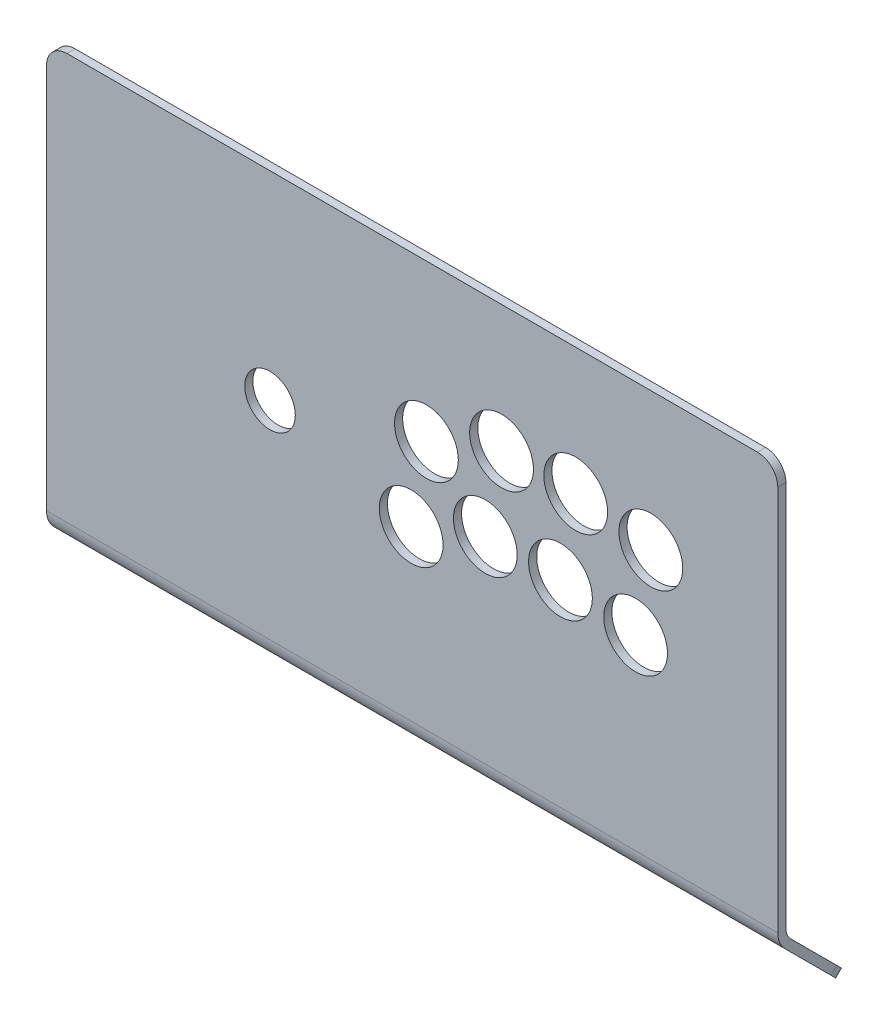
ISO-10303-21;
HEADER;
FILE_DESCRIPTION(('STEP AP214'),'2;1');
FILE_NAME('part.step','',(''),(''),'','','');
FILE_SCHEMA(('AUTOMOTIVE_DESIGN { 1 0 10303 214 1 1 1 1 }'));
ENDSEC;
DATA;
#1=APPLICATION_CONTEXT('core data for automotive mechanical design processes');
#2=APPLICATION_PROTOCOL_DEFINITION('international standard','automotive_design',2000,#1);
#3=PRODUCT_CONTEXT('',#1,'mechanical');
#4=PRODUCT('Part','Part','',(#3));
#5=PRODUCT_RELATED_PRODUCT_CATEGORY('part','',(#4));
#6=PRODUCT_DEFINITION_FORMATION('','',#4);
#7=PRODUCT_DEFINITION_CONTEXT('part definition',#1,'design');
#8=PRODUCT_DEFINITION('design','',#6,#7);
#9=PRODUCT_DEFINITION_SHAPE('','',#8);
#10=(LENGTH_UNIT() NAMED_UNIT(*) SI_UNIT(.MILLI.,.METRE.));
#11=(NAMED_UNIT(*) PLANE_ANGLE_UNIT() SI_UNIT($,.RADIAN.));
#12=(NAMED_UNIT(*) SI_UNIT($,.STERADIAN.) SOLID_ANGLE_UNIT());
#13=UNCERTAINTY_MEASURE_WITH_UNIT(LENGTH_MEASURE(1.E-05),#10,'distance_accuracy_value','');
#14=(GEOMETRIC_REPRESENTATION_CONTEXT(3) GLOBAL_UNCERTAINTY_ASSIGNED_CONTEXT((#13)) GLOBAL_UNIT_ASSIGNED_CONTEXT((#10,
#11,#12)) REPRESENTATION_CONTEXT('',''));
#15=CARTESIAN_POINT('',(0.,0.,0.));
#16=DIRECTION('',(0.,0.,1.));
#17=DIRECTION('',(1.,0.,0.));
#18=AXIS2_PLACEMENT_3D('',#15,#16,#17);
#19=CARTESIAN_POINT('',(180.,0.,2.));
#20=DIRECTION('',(0.,-1.,0.));
#21=DIRECTION('',(0.,0.,-1.));
#22=AXIS2_PLACEMENT_3D('',#19,#20,#21);
#23=PLANE('',#22);
#24=DIRECTION('',(-1.,0.,0.));
#25=VECTOR('',#24,1.);
#26=CARTESIAN_POINT('',(180.,0.,2.));
#27=LINE('',#26,#25);
#28=CARTESIAN_POINT('',(170.,0.,2.));
#29=VERTEX_POINT('',#28);
#30=CARTESIAN_POINT('',(-170.,0.,2.));
#31=VERTEX_POINT('',#30);
#32=EDGE_CURVE('E141',#29,#31,#27,.T.);
#33=ORIENTED_EDGE('',*,*,#32,.F.);
#34=DIRECTION('',(0.,0.,1.));
#35=VECTOR('',#34,1.);
#36=CARTESIAN_POINT('',(170.,0.,-2.));
#37=LINE('',#36,#35);
#38=CARTESIAN_POINT('',(170.,0.,-2.));
#39=VERTEX_POINT('',#38);
#40=EDGE_CURVE('E225',#29,#39,#37,.F.);
#41=ORIENTED_EDGE('',*,*,#40,.T.);
#42=DIRECTION('',(-1.,0.,0.));
#43=VECTOR('',#42,1.);
#44=CARTESIAN_POINT('',(180.,0.,-2.));
#45=LINE('',#44,#43);
#46=CARTESIAN_POINT('',(-170.,0.,-2.));
#47=VERTEX_POINT('',#46);
#48=EDGE_CURVE('E158',#39,#47,#45,.T.);
#49=ORIENTED_EDGE('',*,*,#48,.T.);
#50=DIRECTION('',(0.,0.,1.));
#51=VECTOR('',#50,1.);
#52=CARTESIAN_POINT('',(-170.,0.,2.));
#53=LINE('',#52,#51);
#54=EDGE_CURVE('E222',#47,#31,#53,.T.);
#55=ORIENTED_EDGE('',*,*,#54,.T.);
#56=EDGE_LOOP('',(#33,#41,#49,#55));
#57=FACE_BOUND('',#56,.T.);
#58=ADVANCED_FACE('F32',(#57),#23,.F.);
#59=CARTESIAN_POINT('',(180.,0.,2.));
#60=DIRECTION('',(0.,0.,-1.));
#61=DIRECTION('',(-1.,0.,0.));
#62=AXIS2_PLACEMENT_3D('',#59,#60,#61);
#63=PLANE('',#62);
#64=CARTESIAN_POINT('',(-70.,-98.0000000000002,2.));
#65=DIRECTION('',(0.,0.,1.));
#66=DIRECTION('',(1.,0.,0.));
#67=AXIS2_PLACEMENT_3D('',#64,#65,#66);
#68=CIRCLE('',#67,12.4505949480337);
#69=CARTESIAN_POINT('',(-57.5494050519663,-98.0000000000002,2.));
#70=VERTEX_POINT('',#69);
#71=EDGE_CURVE('E192',#70,#70,#68,.T.);
#72=ORIENTED_EDGE('',*,*,#71,.F.);
#73=EDGE_LOOP('',(#72));
#74=FACE_BOUND('',#73,.T.);
#75=CARTESIAN_POINT('',(110.,-108.,2.));
#76=DIRECTION('',(0.,0.,1.));
#77=DIRECTION('',(1.,0.,0.));
#78=AXIS2_PLACEMENT_3D('',#75,#76,#77);
#79=CIRCLE('',#78,15.7);
#80=CARTESIAN_POINT('',(125.7,-108.,2.));
#81=VERTEX_POINT('',#80);
#82=EDGE_CURVE('E476',#81,#81,#79,.T.);
#83=ORIENTED_EDGE('',*,*,#82,.F.);
#84=EDGE_LOOP('',(#83));
#85=FACE_BOUND('',#84,.T.);
#86=CARTESIAN_POINT('',(117.5,-68.,2.));
#87=DIRECTION('',(0.,0.,1.));
#88=DIRECTION('',(1.,0.,0.));
#89=AXIS2_PLACEMENT_3D('',#86,#87,#88);
#90=CIRCLE('',#89,15.7);
#91=CARTESIAN_POINT('',(133.2,-68.,2.));
#92=VERTEX_POINT('',#91);
#93=EDGE_CURVE('E482',#92,#92,#90,.T.);
#94=ORIENTED_EDGE('',*,*,#93,.F.);
#95=EDGE_LOOP('',(#94));
#96=FACE_BOUND('',#95,.T.);
#97=CARTESIAN_POINT('',(80.4999999999999,-62.5,2.));
#98=DIRECTION('',(0.,0.,1.));
#99=DIRECTION('',(1.,0.,0.));
#100=AXIS2_PLACEMENT_3D('',#97,#98,#99);
#101=CIRCLE('',#100,15.7);
#102=CARTESIAN_POINT('',(96.1999999999999,-62.5,2.));
#103=VERTEX_POINT('',#102);
#104=EDGE_CURVE('E504',#103,#103,#101,.T.);
#105=ORIENTED_EDGE('',*,*,#104,.F.);
#106=EDGE_LOOP('',(#105));
#107=FACE_BOUND('',#106,.T.);
#108=CARTESIAN_POINT('',(43.9999999999999,-62.5,2.));
#109=DIRECTION('',(0.,0.,1.));
#110=DIRECTION('',(1.,0.,0.));
#111=AXIS2_PLACEMENT_3D('',#108,#109,#110);
#112=CIRCLE('',#111,15.7);
#113=CARTESIAN_POINT('',(59.6999999999999,-62.5,2.));
#114=VERTEX_POINT('',#113);
#115=EDGE_CURVE('E507',#114,#114,#112,.T.);
#116=ORIENTED_EDGE('',*,*,#115,.F.);
#117=EDGE_LOOP('',(#116));
#118=FACE_BOUND('',#117,.T.);
#119=CARTESIAN_POINT('',(6.9999999999999,-77.,2.));
#120=DIRECTION('',(0.,0.,1.));
#121=DIRECTION('',(1.,0.,0.));
#122=AXIS2_PLACEMENT_3D('',#119,#120,#121);
#123=CIRCLE('',#122,15.7);
#124=CARTESIAN_POINT('',(22.6999999999999,-77.,2.));
#125=VERTEX_POINT('',#124);
#126=EDGE_CURVE('E486',#125,#125,#123,.T.);
#127=ORIENTED_EDGE('',*,*,#126,.F.);
#128=EDGE_LOOP('',(#127));
#129=FACE_BOUND('',#128,.T.);
#130=CARTESIAN_POINT('',(-0.500000000000084,-117.,2.));
#131=DIRECTION('',(0.,0.,1.));
#132=DIRECTION('',(1.,0.,0.));
#133=AXIS2_PLACEMENT_3D('',#130,#131,#132);
#134=CIRCLE('',#133,15.7);
#135=CARTESIAN_POINT('',(15.1999999999999,-117.,2.));
#136=VERTEX_POINT('',#135);
#137=EDGE_CURVE('E479',#136,#136,#134,.T.);
#138=ORIENTED_EDGE('',*,*,#137,.F.);
#139=EDGE_LOOP('',(#138));
#140=FACE_BOUND('',#139,.T.);
#141=CARTESIAN_POINT('',(35.9999999999999,-103.,2.));
#142=DIRECTION('',(0.,0.,1.));
#143=DIRECTION('',(1.,0.,0.));
#144=AXIS2_PLACEMENT_3D('',#141,#142,#143);
#145=CIRCLE('',#144,15.7);
#146=CARTESIAN_POINT('',(51.6999999999999,-103.,2.));
#147=VERTEX_POINT('',#146);
#148=EDGE_CURVE('E475',#147,#147,#145,.T.);
#149=ORIENTED_EDGE('',*,*,#148,.F.);
#150=EDGE_LOOP('',(#149));
#151=FACE_BOUND('',#150,.T.);
#152=CARTESIAN_POINT('',(72.9999999999999,-103.,2.));
#153=DIRECTION('',(0.,0.,1.));
#154=DIRECTION('',(1.,0.,0.));
#155=AXIS2_PLACEMENT_3D('',#152,#153,#154);
#156=CIRCLE('',#155,15.7);
#157=CARTESIAN_POINT('',(88.6999999999999,-103.,2.));
#158=VERTEX_POINT('',#157);
#159=EDGE_CURVE('E471',#158,#158,#156,.T.);
#160=ORIENTED_EDGE('',*,*,#159,.F.);
#161=EDGE_LOOP('',(#160));
#162=FACE_BOUND('',#161,.T.);
#163=DIRECTION('',(0.,-1.,0.));
#164=VECTOR('',#163,1.);
#165=CARTESIAN_POINT('',(180.,0.,2.));
#166=LINE('',#165,#164);
#167=CARTESIAN_POINT('',(180.,-10.,2.));
#168=VERTEX_POINT('',#167);
#169=CARTESIAN_POINT('',(180.,-200.,2.));
#170=VERTEX_POINT('',#169);
#171=EDGE_CURVE('E121',#168,#170,#166,.T.);
#172=ORIENTED_EDGE('',*,*,#171,.F.);
#173=CARTESIAN_POINT('',(170.,-10.,2.));
#174=DIRECTION('',(0.,0.,-1.));
#175=DIRECTION('',(-1.,0.,0.));
#176=AXIS2_PLACEMENT_3D('',#173,#174,#175);
#177=CIRCLE('',#176,10.);
#178=EDGE_CURVE('E220',#168,#29,#177,.F.);
#179=ORIENTED_EDGE('',*,*,#178,.T.);
#180=ORIENTED_EDGE('',*,*,#32,.T.);
#181=CARTESIAN_POINT('',(-170.,-10.,2.));
#182=DIRECTION('',(0.,0.,-1.));
#183=DIRECTION('',(-1.,0.,0.));
#184=AXIS2_PLACEMENT_3D('',#181,#182,#183);
#185=CIRCLE('',#184,10.);
#186=CARTESIAN_POINT('',(-180.,-10.,2.));
#187=VERTEX_POINT('',#186);
#188=EDGE_CURVE('E218',#31,#187,#185,.F.);
#189=ORIENTED_EDGE('',*,*,#188,.T.);
#190=DIRECTION('',(0.,-1.,0.));
#191=VECTOR('',#190,1.);
#192=CARTESIAN_POINT('',(-180.,0.,2.));
#193=LINE('',#192,#191);
#194=CARTESIAN_POINT('',(-180.,-200.,2.));
#195=VERTEX_POINT('',#194);
#196=EDGE_CURVE('E138',#187,#195,#193,.T.);
#197=ORIENTED_EDGE('',*,*,#196,.T.);
#198=DIRECTION('',(-1.,0.,0.));
#199=VECTOR('',#198,1.);
#200=CARTESIAN_POINT('',(180.,-200.,2.));
#201=LINE('',#200,#199);
#202=EDGE_CURVE('E135',#170,#195,#201,.T.);
#203=ORIENTED_EDGE('',*,*,#202,.F.);
#204=EDGE_LOOP('',(#172,#179,#180,#189,#197,#203));
#205=FACE_BOUND('',#204,.T.);
#206=ADVANCED_FACE('F136',(#74,#85,#96,#107,#118,#129,#140,#151,#162,#205),#63,.F.);
#207=CARTESIAN_POINT('',(180.,-200.,-10.));
#208=DIRECTION('',(-1.,0.,0.));
#209=DIRECTION('',(0.,0.,1.));
#210=AXIS2_PLACEMENT_3D('',#207,#208,#209);
#211=CYLINDRICAL_SURFACE('',#210,12.);
#212=CARTESIAN_POINT('',(-180.,-200.,-10.));
#213=DIRECTION('',(1.,0.,0.));
#214=DIRECTION('',(0.,0.,-1.));
#215=AXIS2_PLACEMENT_3D('',#212,#213,#214);
#216=CIRCLE('',#215,12.);
#217=CARTESIAN_POINT('',(-180.,-208.485281374239,-1.51471862576142));
#218=VERTEX_POINT('',#217);
#219=EDGE_CURVE('E160',#195,#218,#216,.T.);
#220=ORIENTED_EDGE('',*,*,#219,.T.);
#221=DIRECTION('',(-1.,0.,0.));
#222=VECTOR('',#221,1.);
#223=CARTESIAN_POINT('',(180.,-208.485281374239,-1.51471862576142));
#224=LINE('',#223,#222);
#225=CARTESIAN_POINT('',(180.,-208.485281374239,-1.51471862576142));
#226=VERTEX_POINT('',#225);
#227=EDGE_CURVE('E142',#226,#218,#224,.T.);
#228=ORIENTED_EDGE('',*,*,#227,.F.);
#229=CARTESIAN_POINT('',(180.,-200.,-10.));
#230=DIRECTION('',(1.,0.,0.));
#231=DIRECTION('',(0.,0.,-1.));
#232=AXIS2_PLACEMENT_3D('',#229,#230,#231);
#233=CIRCLE('',#232,12.);
#234=EDGE_CURVE('E127',#170,#226,#233,.T.);
#235=ORIENTED_EDGE('',*,*,#234,.F.);
#236=ORIENTED_EDGE('',*,*,#202,.T.);
#237=EDGE_LOOP('',(#220,#228,#235,#236));
#238=FACE_BOUND('',#237,.T.);
#239=ADVANCED_FACE('F144',(#238),#211,.T.);
#240=CARTESIAN_POINT('',(180.,-208.485281374239,-1.51471862576144));
#241=DIRECTION('',(0.,0.70710678118655,-0.707106781186545));
#242=DIRECTION('',(0.,0.707106781186545,0.70710678118655));
#243=AXIS2_PLACEMENT_3D('',#240,#241,#242);
#244=PLANE('',#243);
#245=DIRECTION('',(-1.,0.,0.));
#246=VECTOR('',#245,1.);
#247=CARTESIAN_POINT('',(180.,-238.287003774127,-31.3164410256498));
#248=LINE('',#247,#246);
#249=CARTESIAN_POINT('',(170.,-238.287003774127,-31.3164410256498));
#250=VERTEX_POINT('',#249);
#251=CARTESIAN_POINT('',(-170.,-238.287003774127,-31.3164410256498));
#252=VERTEX_POINT('',#251);
#253=EDGE_CURVE('E182',#250,#252,#248,.T.);
#254=ORIENTED_EDGE('',*,*,#253,.F.);
#255=CARTESIAN_POINT('',(170.,-231.215935962261,-24.2453732137843));
#256=DIRECTION('',(0.,0.70710678118655,-0.707106781186545));
#257=DIRECTION('',(0.,0.707106781186545,0.70710678118655));
#258=AXIS2_PLACEMENT_3D('',#255,#256,#257);
#259=CIRCLE('',#258,10.);
#260=CARTESIAN_POINT('',(180.,-231.215935962261,-24.2453732137843));
#261=VERTEX_POINT('',#260);
#262=EDGE_CURVE('E11',#250,#261,#259,.F.);
#263=ORIENTED_EDGE('',*,*,#262,.T.);
#264=DIRECTION('',(0.,-0.707106781186545,-0.70710678118655));
#265=VECTOR('',#264,1.);
#266=CARTESIAN_POINT('',(180.,-208.485281374239,-1.51471862576144));
#267=LINE('',#266,#265);
#268=EDGE_CURVE('E147',#226,#261,#267,.T.);
#269=ORIENTED_EDGE('',*,*,#268,.F.);
#270=ORIENTED_EDGE('',*,*,#227,.T.);
#271=DIRECTION('',(0.,-0.707106781186545,-0.70710678118655));
#272=VECTOR('',#271,1.);
#273=CARTESIAN_POINT('',(-180.,-208.485281374239,-1.51471862576144));
#274=LINE('',#273,#272);
#275=CARTESIAN_POINT('',(-180.,-231.215935962261,-24.2453732137843));
#276=VERTEX_POINT('',#275);
#277=EDGE_CURVE('E163',#218,#276,#274,.T.);
#278=ORIENTED_EDGE('',*,*,#277,.T.);
#279=CARTESIAN_POINT('',(-170.,-231.215935962261,-24.2453732137843));
#280=DIRECTION('',(0.,0.70710678118655,-0.707106781186545));
#281=DIRECTION('',(0.,0.707106781186545,0.70710678118655));
#282=AXIS2_PLACEMENT_3D('',#279,#280,#281);
#283=CIRCLE('',#282,10.);
#284=EDGE_CURVE('E40',#276,#252,#283,.F.);
#285=ORIENTED_EDGE('',*,*,#284,.T.);
#286=EDGE_LOOP('',(#254,#263,#269,#270,#278,#285));
#287=FACE_BOUND('',#286,.T.);
#288=ADVANCED_FACE('F254',(#287),#244,.F.);
#289=CARTESIAN_POINT('',(180.,-238.287003774127,-31.3164410256498));
#290=DIRECTION('',(0.,0.707106781186547,0.707106781186547));
#291=DIRECTION('',(0.,-0.707106781186548,0.707106781186548));
#292=AXIS2_PLACEMENT_3D('',#289,#290,#291);
#293=PLANE('',#292);
#294=DIRECTION('',(-1.,0.,0.));
#295=VECTOR('',#294,1.);
#296=CARTESIAN_POINT('',(180.,-235.458576649381,-34.144868150396));
#297=LINE('',#296,#295);
#298=CARTESIAN_POINT('',(170.,-235.458576649381,-34.144868150396));
#299=VERTEX_POINT('',#298);
#300=CARTESIAN_POINT('',(-170.,-235.458576649381,-34.144868150396));
#301=VERTEX_POINT('',#300);
#302=EDGE_CURVE('E179',#299,#301,#297,.T.);
#303=ORIENTED_EDGE('',*,*,#302,.F.);
#304=DIRECTION('',(0.,0.707106781186548,-0.707106781186548));
#305=VECTOR('',#304,1.);
#306=CARTESIAN_POINT('',(170.,-238.287003774127,-31.3164410256498));
#307=LINE('',#306,#305);
#308=EDGE_CURVE('E53',#299,#250,#307,.F.);
#309=ORIENTED_EDGE('',*,*,#308,.T.);
#310=ORIENTED_EDGE('',*,*,#253,.T.);
#311=DIRECTION('',(0.,0.707106781186548,-0.707106781186548));
#312=VECTOR('',#311,1.);
#313=CARTESIAN_POINT('',(-170.,-238.287003774127,-31.3164410256498));
#314=LINE('',#313,#312);
#315=EDGE_CURVE('E239',#252,#301,#314,.T.);
#316=ORIENTED_EDGE('',*,*,#315,.T.);
#317=EDGE_LOOP('',(#303,#309,#310,#316));
#318=FACE_BOUND('',#317,.T.);
#319=ADVANCED_FACE('F243',(#318),#293,.F.);
#320=CARTESIAN_POINT('',(180.,-205.656854249492,-4.34314575050763));
#321=DIRECTION('',(0.,-0.707106781186549,0.707106781186546));
#322=DIRECTION('',(0.,-0.707106781186546,-0.707106781186549));
#323=AXIS2_PLACEMENT_3D('',#320,#321,#322);
#324=PLANE('',#323);
#325=DIRECTION('',(0.,0.707106781186546,0.707106781186549));
#326=VECTOR('',#325,1.);
#327=CARTESIAN_POINT('',(180.,-205.656854249492,-4.34314575050763));
#328=LINE('',#327,#326);
#329=CARTESIAN_POINT('',(180.,-228.387508837515,-27.0738003385305));
#330=VERTEX_POINT('',#329);
#331=CARTESIAN_POINT('',(180.,-205.656854249492,-4.34314575050763));
#332=VERTEX_POINT('',#331);
#333=EDGE_CURVE('E149',#330,#332,#328,.T.);
#334=ORIENTED_EDGE('',*,*,#333,.F.);
#335=CARTESIAN_POINT('',(170.,-228.387508837515,-27.0738003385305));
#336=DIRECTION('',(0.,-0.707106781186549,0.707106781186546));
#337=DIRECTION('',(0.,-0.707106781186546,-0.707106781186549));
#338=AXIS2_PLACEMENT_3D('',#335,#336,#337);
#339=CIRCLE('',#338,10.);
#340=EDGE_CURVE('E237',#330,#299,#339,.F.);
#341=ORIENTED_EDGE('',*,*,#340,.T.);
#342=ORIENTED_EDGE('',*,*,#302,.T.);
#343=CARTESIAN_POINT('',(-170.,-228.387508837515,-27.0738003385305));
#344=DIRECTION('',(0.,-0.707106781186549,0.707106781186546));
#345=DIRECTION('',(0.,-0.707106781186546,-0.707106781186549));
#346=AXIS2_PLACEMENT_3D('',#343,#344,#345);
#347=CIRCLE('',#346,10.);
#348=CARTESIAN_POINT('',(-180.,-228.387508837515,-27.0738003385304));
#349=VERTEX_POINT('',#348);
#350=EDGE_CURVE('E235',#301,#349,#347,.F.);
#351=ORIENTED_EDGE('',*,*,#350,.T.);
#352=DIRECTION('',(0.,0.707106781186546,0.707106781186549));
#353=VECTOR('',#352,1.);
#354=CARTESIAN_POINT('',(-180.,-205.656854249492,-4.34314575050763));
#355=LINE('',#354,#353);
#356=CARTESIAN_POINT('',(-180.,-205.656854249492,-4.34314575050763));
#357=VERTEX_POINT('',#356);
#358=EDGE_CURVE('E165',#349,#357,#355,.T.);
#359=ORIENTED_EDGE('',*,*,#358,.T.);
#360=DIRECTION('',(-1.,0.,0.));
#361=VECTOR('',#360,1.);
#362=CARTESIAN_POINT('',(180.,-205.656854249492,-4.34314575050763));
#363=LINE('',#362,#361);
#364=EDGE_CURVE('E176',#332,#357,#363,.T.);
#365=ORIENTED_EDGE('',*,*,#364,.F.);
#366=EDGE_LOOP('',(#334,#341,#342,#351,#359,#365));
#367=FACE_BOUND('',#366,.T.);
#368=ADVANCED_FACE('F247',(#367),#324,.F.);
#369=CARTESIAN_POINT('',(180.,-200.,-10.));
#370=DIRECTION('',(-1.,0.,0.));
#371=DIRECTION('',(0.,0.,1.));
#372=AXIS2_PLACEMENT_3D('',#369,#370,#371);
#373=CYLINDRICAL_SURFACE('',#372,8.00000000000001);
#374=CARTESIAN_POINT('',(-180.,-200.,-10.));
#375=DIRECTION('',(-1.,0.,0.));
#376=DIRECTION('',(0.,0.,-1.));
#377=AXIS2_PLACEMENT_3D('',#374,#375,#376);
#378=CIRCLE('',#377,8.00000000000001);
#379=CARTESIAN_POINT('',(-180.,-200.,-2.00000000000002));
#380=VERTEX_POINT('',#379);
#381=EDGE_CURVE('E167',#357,#380,#378,.T.);
#382=ORIENTED_EDGE('',*,*,#381,.T.);
#383=DIRECTION('',(-1.,0.,0.));
#384=VECTOR('',#383,1.);
#385=CARTESIAN_POINT('',(180.,-200.,-2.00000000000002));
#386=LINE('',#385,#384);
#387=CARTESIAN_POINT('',(180.,-200.,-2.00000000000002));
#388=VERTEX_POINT('',#387);
#389=EDGE_CURVE('E173',#388,#380,#386,.T.);
#390=ORIENTED_EDGE('',*,*,#389,.F.);
#391=CARTESIAN_POINT('',(180.,-200.,-10.));
#392=DIRECTION('',(-1.,0.,0.));
#393=DIRECTION('',(0.,0.,-1.));
#394=AXIS2_PLACEMENT_3D('',#391,#392,#393);
#395=CIRCLE('',#394,8.00000000000001);
#396=EDGE_CURVE('E154',#332,#388,#395,.T.);
#397=ORIENTED_EDGE('',*,*,#396,.F.);
#398=ORIENTED_EDGE('',*,*,#364,.T.);
#399=EDGE_LOOP('',(#382,#390,#397,#398));
#400=FACE_BOUND('',#399,.T.);
#401=ADVANCED_FACE('F298',(#400),#373,.F.);
#402=CARTESIAN_POINT('',(180.,0.,-2.));
#403=DIRECTION('',(0.,0.,1.));
#404=DIRECTION('',(1.,0.,0.));
#405=AXIS2_PLACEMENT_3D('',#402,#403,#404);
#406=PLANE('',#405);
#407=CARTESIAN_POINT('',(-70.,-98.0000000000002,-2.));
#408=DIRECTION('',(0.,0.,1.));
#409=DIRECTION('',(1.,0.,0.));
#410=AXIS2_PLACEMENT_3D('',#407,#408,#409);
#411=CIRCLE('',#410,12.4505949480337);
#412=CARTESIAN_POINT('',(-57.5494050519663,-98.0000000000002,-2.));
#413=VERTEX_POINT('',#412);
#414=EDGE_CURVE('E161',#413,#413,#411,.T.);
#415=ORIENTED_EDGE('',*,*,#414,.T.);
#416=EDGE_LOOP('',(#415));
#417=FACE_BOUND('',#416,.T.);
#418=CARTESIAN_POINT('',(110.,-108.,-2.));
#419=DIRECTION('',(0.,0.,1.));
#420=DIRECTION('',(1.,0.,0.));
#421=AXIS2_PLACEMENT_3D('',#418,#419,#420);
#422=CIRCLE('',#421,15.7);
#423=CARTESIAN_POINT('',(125.7,-108.,-2.));
#424=VERTEX_POINT('',#423);
#425=EDGE_CURVE('E210',#424,#424,#422,.T.);
#426=ORIENTED_EDGE('',*,*,#425,.T.);
#427=EDGE_LOOP('',(#426));
#428=FACE_BOUND('',#427,.T.);
#429=CARTESIAN_POINT('',(117.5,-68.,-2.));
#430=DIRECTION('',(0.,0.,1.));
#431=DIRECTION('',(1.,0.,0.));
#432=AXIS2_PLACEMENT_3D('',#429,#430,#431);
#433=CIRCLE('',#432,15.7);
#434=CARTESIAN_POINT('',(133.2,-68.,-2.));
#435=VERTEX_POINT('',#434);
#436=EDGE_CURVE('E207',#435,#435,#433,.T.);
#437=ORIENTED_EDGE('',*,*,#436,.T.);
#438=EDGE_LOOP('',(#437));
#439=FACE_BOUND('',#438,.T.);
#440=CARTESIAN_POINT('',(80.4999999999999,-62.5,-2.));
#441=DIRECTION('',(0.,0.,1.));
#442=DIRECTION('',(1.,0.,0.));
#443=AXIS2_PLACEMENT_3D('',#440,#441,#442);
#444=CIRCLE('',#443,15.7);
#445=CARTESIAN_POINT('',(96.1999999999999,-62.5,-2.));
#446=VERTEX_POINT('',#445);
#447=EDGE_CURVE('E204',#446,#446,#444,.T.);
#448=ORIENTED_EDGE('',*,*,#447,.T.);
#449=EDGE_LOOP('',(#448));
#450=FACE_BOUND('',#449,.T.);
#451=CARTESIAN_POINT('',(43.9999999999999,-62.5,-2.));
#452=DIRECTION('',(0.,0.,1.));
#453=DIRECTION('',(1.,0.,0.));
#454=AXIS2_PLACEMENT_3D('',#451,#452,#453);
#455=CIRCLE('',#454,15.7);
#456=CARTESIAN_POINT('',(59.6999999999999,-62.5,-2.));
#457=VERTEX_POINT('',#456);
#458=EDGE_CURVE('E201',#457,#457,#455,.T.);
#459=ORIENTED_EDGE('',*,*,#458,.T.);
#460=EDGE_LOOP('',(#459));
#461=FACE_BOUND('',#460,.T.);
#462=CARTESIAN_POINT('',(6.9999999999999,-77.,-2.));
#463=DIRECTION('',(0.,0.,1.));
#464=DIRECTION('',(1.,0.,0.));
#465=AXIS2_PLACEMENT_3D('',#462,#463,#464);
#466=CIRCLE('',#465,15.7);
#467=CARTESIAN_POINT('',(22.6999999999999,-77.,-2.));
#468=VERTEX_POINT('',#467);
#469=EDGE_CURVE('E198',#468,#468,#466,.T.);
#470=ORIENTED_EDGE('',*,*,#469,.T.);
#471=EDGE_LOOP('',(#470));
#472=FACE_BOUND('',#471,.T.);
#473=CARTESIAN_POINT('',(-0.500000000000084,-117.,-2.));
#474=DIRECTION('',(0.,0.,1.));
#475=DIRECTION('',(1.,0.,0.));
#476=AXIS2_PLACEMENT_3D('',#473,#474,#475);
#477=CIRCLE('',#476,15.7);
#478=CARTESIAN_POINT('',(15.1999999999999,-117.,-2.));
#479=VERTEX_POINT('',#478);
#480=EDGE_CURVE('E195',#479,#479,#477,.T.);
#481=ORIENTED_EDGE('',*,*,#480,.T.);
#482=EDGE_LOOP('',(#481));
#483=FACE_BOUND('',#482,.T.);
#484=CARTESIAN_POINT('',(35.9999999999999,-103.,-2.));
#485=DIRECTION('',(0.,0.,1.));
#486=DIRECTION('',(1.,0.,0.));
#487=AXIS2_PLACEMENT_3D('',#484,#485,#486);
#488=CIRCLE('',#487,15.7);
#489=CARTESIAN_POINT('',(51.6999999999999,-103.,-2.));
#490=VERTEX_POINT('',#489);
#491=EDGE_CURVE('E191',#490,#490,#488,.T.);
#492=ORIENTED_EDGE('',*,*,#491,.T.);
#493=EDGE_LOOP('',(#492));
#494=FACE_BOUND('',#493,.T.);
#495=CARTESIAN_POINT('',(72.9999999999999,-103.,-2.));
#496=DIRECTION('',(0.,0.,1.));
#497=DIRECTION('',(1.,0.,0.));
#498=AXIS2_PLACEMENT_3D('',#495,#496,#497);
#499=CIRCLE('',#498,15.7);
#500=CARTESIAN_POINT('',(88.6999999999999,-103.,-2.));
#501=VERTEX_POINT('',#500);
#502=EDGE_CURVE('E188',#501,#501,#499,.T.);
#503=ORIENTED_EDGE('',*,*,#502,.T.);
#504=EDGE_LOOP('',(#503));
#505=FACE_BOUND('',#504,.T.);
#506=ORIENTED_EDGE('',*,*,#48,.F.);
#507=CARTESIAN_POINT('',(170.,-10.,-2.));
#508=DIRECTION('',(0.,0.,1.));
#509=DIRECTION('',(1.,0.,0.));
#510=AXIS2_PLACEMENT_3D('',#507,#508,#509);
#511=CIRCLE('',#510,10.);
#512=CARTESIAN_POINT('',(180.,-10.,-2.));
#513=VERTEX_POINT('',#512);
#514=EDGE_CURVE('E229',#39,#513,#511,.F.);
#515=ORIENTED_EDGE('',*,*,#514,.T.);
#516=DIRECTION('',(0.,1.,0.));
#517=VECTOR('',#516,1.);
#518=CARTESIAN_POINT('',(180.,0.,-2.));
#519=LINE('',#518,#517);
#520=EDGE_CURVE('E156',#388,#513,#519,.T.);
#521=ORIENTED_EDGE('',*,*,#520,.F.);
#522=ORIENTED_EDGE('',*,*,#389,.T.);
#523=DIRECTION('',(0.,1.,0.));
#524=VECTOR('',#523,1.);
#525=CARTESIAN_POINT('',(-180.,0.,-2.));
#526=LINE('',#525,#524);
#527=CARTESIAN_POINT('',(-180.,-10.,-2.));
#528=VERTEX_POINT('',#527);
#529=EDGE_CURVE('E132',#380,#528,#526,.T.);
#530=ORIENTED_EDGE('',*,*,#529,.T.);
#531=CARTESIAN_POINT('',(-170.,-10.,-2.));
#532=DIRECTION('',(0.,0.,1.));
#533=DIRECTION('',(1.,0.,0.));
#534=AXIS2_PLACEMENT_3D('',#531,#532,#533);
#535=CIRCLE('',#534,10.);
#536=EDGE_CURVE('E227',#528,#47,#535,.F.);
#537=ORIENTED_EDGE('',*,*,#536,.T.);
#538=EDGE_LOOP('',(#506,#515,#521,#522,#530,#537));
#539=FACE_BOUND('',#538,.T.);
#540=ADVANCED_FACE('F290',(#417,#428,#439,#450,#461,#472,#483,#494,#505,#539),#406,.F.);
#541=CARTESIAN_POINT('',(180.,-200.,-10.));
#542=DIRECTION('',(1.,0.,0.));
#543=DIRECTION('',(0.,0.,-1.));
#544=AXIS2_PLACEMENT_3D('',#541,#542,#543);
#545=PLANE('',#544);
#546=ORIENTED_EDGE('',*,*,#520,.T.);
#547=DIRECTION('',(0.,0.,1.));
#548=VECTOR('',#547,1.);
#549=CARTESIAN_POINT('',(180.,-10.,2.));
#550=LINE('',#549,#548);
#551=EDGE_CURVE('E130',#513,#168,#550,.T.);
#552=ORIENTED_EDGE('',*,*,#551,.T.);
#553=ORIENTED_EDGE('',*,*,#171,.T.);
#554=ORIENTED_EDGE('',*,*,#234,.T.);
#555=ORIENTED_EDGE('',*,*,#268,.T.);
#556=DIRECTION('',(0.,0.707106781186548,-0.707106781186548));
#557=VECTOR('',#556,1.);
#558=CARTESIAN_POINT('',(180.,-228.387508837515,-27.0738003385305));
#559=LINE('',#558,#557);
#560=EDGE_CURVE('E187',#261,#330,#559,.T.);
#561=ORIENTED_EDGE('',*,*,#560,.T.);
#562=ORIENTED_EDGE('',*,*,#333,.T.);
#563=ORIENTED_EDGE('',*,*,#396,.T.);
#564=EDGE_LOOP('',(#546,#552,#553,#554,#555,#561,#562,#563));
#565=FACE_BOUND('',#564,.T.);
#566=ADVANCED_FACE('F124',(#565),#545,.T.);
#567=CARTESIAN_POINT('',(-180.,-200.,-10.));
#568=DIRECTION('',(1.,0.,0.));
#569=DIRECTION('',(0.,0.,-1.));
#570=AXIS2_PLACEMENT_3D('',#567,#568,#569);
#571=PLANE('',#570);
#572=ORIENTED_EDGE('',*,*,#196,.F.);
#573=DIRECTION('',(0.,0.,1.));
#574=VECTOR('',#573,1.);
#575=CARTESIAN_POINT('',(-180.,-10.,-10.));
#576=LINE('',#575,#574);
#577=EDGE_CURVE('E233',#187,#528,#576,.F.);
#578=ORIENTED_EDGE('',*,*,#577,.T.);
#579=ORIENTED_EDGE('',*,*,#529,.F.);
#580=ORIENTED_EDGE('',*,*,#381,.F.);
#581=ORIENTED_EDGE('',*,*,#358,.F.);
#582=DIRECTION('',(0.,0.707106781186548,-0.707106781186548));
#583=VECTOR('',#582,1.);
#584=CARTESIAN_POINT('',(-180.,-222.730654588023,-32.7306545880228));
#585=LINE('',#584,#583);
#586=EDGE_CURVE('E231',#349,#276,#585,.F.);
#587=ORIENTED_EDGE('',*,*,#586,.T.);
#588=ORIENTED_EDGE('',*,*,#277,.F.);
#589=ORIENTED_EDGE('',*,*,#219,.F.);
#590=EDGE_LOOP('',(#572,#578,#579,#580,#581,#587,#588,#589));
#591=FACE_BOUND('',#590,.T.);
#592=ADVANCED_FACE('F257',(#591),#571,.F.);
#593=CARTESIAN_POINT('',(72.9999999999999,-103.,-34.144868150396));
#594=DIRECTION('',(0.,0.,1.));
#595=DIRECTION('',(1.,0.,0.));
#596=AXIS2_PLACEMENT_3D('',#593,#594,#595);
#597=CYLINDRICAL_SURFACE('',#596,15.7);
#598=ORIENTED_EDGE('',*,*,#159,.T.);
#599=EDGE_LOOP('',(#598));
#600=FACE_BOUND('',#599,.T.);
#601=ORIENTED_EDGE('',*,*,#502,.F.);
#602=EDGE_LOOP('',(#601));
#603=FACE_BOUND('',#602,.T.);
#604=ADVANCED_FACE('F354',(#600,#603),#597,.F.);
#605=CARTESIAN_POINT('',(35.9999999999999,-103.,-34.144868150396));
#606=DIRECTION('',(0.,0.,1.));
#607=DIRECTION('',(1.,0.,0.));
#608=AXIS2_PLACEMENT_3D('',#605,#606,#607);
#609=CYLINDRICAL_SURFACE('',#608,15.7);
#610=ORIENTED_EDGE('',*,*,#148,.T.);
#611=EDGE_LOOP('',(#610));
#612=FACE_BOUND('',#611,.T.);
#613=ORIENTED_EDGE('',*,*,#491,.F.);
#614=EDGE_LOOP('',(#613));
#615=FACE_BOUND('',#614,.T.);
#616=ADVANCED_FACE('F431',(#612,#615),#609,.F.);
#617=CARTESIAN_POINT('',(-0.500000000000084,-117.,-34.144868150396));
#618=DIRECTION('',(0.,0.,1.));
#619=DIRECTION('',(1.,0.,0.));
#620=AXIS2_PLACEMENT_3D('',#617,#618,#619);
#621=CYLINDRICAL_SURFACE('',#620,15.7);
#622=ORIENTED_EDGE('',*,*,#137,.T.);
#623=EDGE_LOOP('',(#622));
#624=FACE_BOUND('',#623,.T.);
#625=ORIENTED_EDGE('',*,*,#480,.F.);
#626=EDGE_LOOP('',(#625));
#627=FACE_BOUND('',#626,.T.);
#628=ADVANCED_FACE('F423',(#624,#627),#621,.F.);
#629=CARTESIAN_POINT('',(6.9999999999999,-77.,-34.144868150396));
#630=DIRECTION('',(0.,0.,1.));
#631=DIRECTION('',(1.,0.,0.));
#632=AXIS2_PLACEMENT_3D('',#629,#630,#631);
#633=CYLINDRICAL_SURFACE('',#632,15.7);
#634=ORIENTED_EDGE('',*,*,#126,.T.);
#635=EDGE_LOOP('',(#634));
#636=FACE_BOUND('',#635,.T.);
#637=ORIENTED_EDGE('',*,*,#469,.F.);
#638=EDGE_LOOP('',(#637));
#639=FACE_BOUND('',#638,.T.);
#640=ADVANCED_FACE('F415',(#636,#639),#633,.F.);
#641=CARTESIAN_POINT('',(43.9999999999999,-62.5,-34.144868150396));
#642=DIRECTION('',(0.,0.,1.));
#643=DIRECTION('',(1.,0.,0.));
#644=AXIS2_PLACEMENT_3D('',#641,#642,#643);
#645=CYLINDRICAL_SURFACE('',#644,15.7);
#646=ORIENTED_EDGE('',*,*,#115,.T.);
#647=EDGE_LOOP('',(#646));
#648=FACE_BOUND('',#647,.T.);
#649=ORIENTED_EDGE('',*,*,#458,.F.);
#650=EDGE_LOOP('',(#649));
#651=FACE_BOUND('',#650,.T.);
#652=ADVANCED_FACE('F407',(#648,#651),#645,.F.);
#653=CARTESIAN_POINT('',(80.4999999999999,-62.5,-34.144868150396));
#654=DIRECTION('',(0.,0.,1.));
#655=DIRECTION('',(1.,0.,0.));
#656=AXIS2_PLACEMENT_3D('',#653,#654,#655);
#657=CYLINDRICAL_SURFACE('',#656,15.7);
#658=ORIENTED_EDGE('',*,*,#104,.T.);
#659=EDGE_LOOP('',(#658));
#660=FACE_BOUND('',#659,.T.);
#661=ORIENTED_EDGE('',*,*,#447,.F.);
#662=EDGE_LOOP('',(#661));
#663=FACE_BOUND('',#662,.T.);
#664=ADVANCED_FACE('F399',(#660,#663),#657,.F.);
#665=CARTESIAN_POINT('',(117.5,-68.,-34.144868150396));
#666=DIRECTION('',(0.,0.,1.));
#667=DIRECTION('',(1.,0.,0.));
#668=AXIS2_PLACEMENT_3D('',#665,#666,#667);
#669=CYLINDRICAL_SURFACE('',#668,15.7);
#670=ORIENTED_EDGE('',*,*,#93,.T.);
#671=EDGE_LOOP('',(#670));
#672=FACE_BOUND('',#671,.T.);
#673=ORIENTED_EDGE('',*,*,#436,.F.);
#674=EDGE_LOOP('',(#673));
#675=FACE_BOUND('',#674,.T.);
#676=ADVANCED_FACE('F391',(#672,#675),#669,.F.);
#677=CARTESIAN_POINT('',(110.,-108.,-34.144868150396));
#678=DIRECTION('',(0.,0.,1.));
#679=DIRECTION('',(1.,0.,0.));
#680=AXIS2_PLACEMENT_3D('',#677,#678,#679);
#681=CYLINDRICAL_SURFACE('',#680,15.7);
#682=ORIENTED_EDGE('',*,*,#82,.T.);
#683=EDGE_LOOP('',(#682));
#684=FACE_BOUND('',#683,.T.);
#685=ORIENTED_EDGE('',*,*,#425,.F.);
#686=EDGE_LOOP('',(#685));
#687=FACE_BOUND('',#686,.T.);
#688=ADVANCED_FACE('F384',(#684,#687),#681,.F.);
#689=CARTESIAN_POINT('',(-70.,-98.0000000000002,-34.144868150396));
#690=DIRECTION('',(0.,0.,1.));
#691=DIRECTION('',(1.,0.,0.));
#692=AXIS2_PLACEMENT_3D('',#689,#690,#691);
#693=CYLINDRICAL_SURFACE('',#692,12.4505949480337);
#694=ORIENTED_EDGE('',*,*,#71,.T.);
#695=EDGE_LOOP('',(#694));
#696=FACE_BOUND('',#695,.T.);
#697=ORIENTED_EDGE('',*,*,#414,.F.);
#698=EDGE_LOOP('',(#697));
#699=FACE_BOUND('',#698,.T.);
#700=ADVANCED_FACE('F279',(#696,#699),#693,.F.);
#701=CARTESIAN_POINT('',(170.,-10.,-10.));
#702=DIRECTION('',(0.,0.,-1.));
#703=DIRECTION('',(-1.,0.,0.));
#704=AXIS2_PLACEMENT_3D('',#701,#702,#703);
#705=CYLINDRICAL_SURFACE('',#704,10.);
#706=ORIENTED_EDGE('',*,*,#514,.F.);
#707=ORIENTED_EDGE('',*,*,#40,.F.);
#708=ORIENTED_EDGE('',*,*,#178,.F.);
#709=ORIENTED_EDGE('',*,*,#551,.F.);
#710=EDGE_LOOP('',(#706,#707,#708,#709));
#711=FACE_BOUND('',#710,.T.);
#712=ADVANCED_FACE('F276',(#711),#705,.T.);
#713=CARTESIAN_POINT('',(-170.,-10.,2.));
#714=DIRECTION('',(0.,0.,1.));
#715=DIRECTION('',(1.,0.,0.));
#716=AXIS2_PLACEMENT_3D('',#713,#714,#715);
#717=CYLINDRICAL_SURFACE('',#716,10.);
#718=ORIENTED_EDGE('',*,*,#536,.F.);
#719=ORIENTED_EDGE('',*,*,#577,.F.);
#720=ORIENTED_EDGE('',*,*,#188,.F.);
#721=ORIENTED_EDGE('',*,*,#54,.F.);
#722=EDGE_LOOP('',(#718,#719,#720,#721));
#723=FACE_BOUND('',#722,.T.);
#724=ADVANCED_FACE('F264',(#723),#717,.T.);
#725=CARTESIAN_POINT('',(170.,-222.730654588023,-32.7306545880228));
#726=DIRECTION('',(0.,-0.707106781186548,0.707106781186548));
#727=DIRECTION('',(0.,-0.707106781186548,-0.707106781186548));
#728=AXIS2_PLACEMENT_3D('',#725,#726,#727);
#729=CYLINDRICAL_SURFACE('',#728,10.);
#730=ORIENTED_EDGE('',*,*,#262,.F.);
#731=ORIENTED_EDGE('',*,*,#308,.F.);
#732=ORIENTED_EDGE('',*,*,#340,.F.);
#733=ORIENTED_EDGE('',*,*,#560,.F.);
#734=EDGE_LOOP('',(#730,#731,#732,#733));
#735=FACE_BOUND('',#734,.T.);
#736=ADVANCED_FACE('F253',(#735),#729,.T.);
#737=CARTESIAN_POINT('',(-170.,-231.215935962261,-24.2453732137843));
#738=DIRECTION('',(0.,0.707106781186548,-0.707106781186548));
#739=DIRECTION('',(0.,0.707106781186548,0.707106781186548));
#740=AXIS2_PLACEMENT_3D('',#737,#738,#739);
#741=CYLINDRICAL_SURFACE('',#740,10.);
#742=ORIENTED_EDGE('',*,*,#284,.F.);
#743=ORIENTED_EDGE('',*,*,#586,.F.);
#744=ORIENTED_EDGE('',*,*,#350,.F.);
#745=ORIENTED_EDGE('',*,*,#315,.F.);
#746=EDGE_LOOP('',(#742,#743,#744,#745));
#747=FACE_BOUND('',#746,.T.);
#748=ADVANCED_FACE('F34',(#747),#741,.T.);
#749=CLOSED_SHELL('',(#58,#206,#239,#288,#319,#368,#401,#540,#566,#592,#604,#616,#628,#640,#652,
#664,#676,#688,#700,#712,#724,#736,#748));
#750=MANIFOLD_SOLID_BREP('B2',#749);
#751=ADVANCED_BREP_SHAPE_REPRESENTATION('',(#18,#750),#14);
#752=SHAPE_DEFINITION_REPRESENTATION(#9,#751);
ENDSEC;
END-ISO-10303-21;
